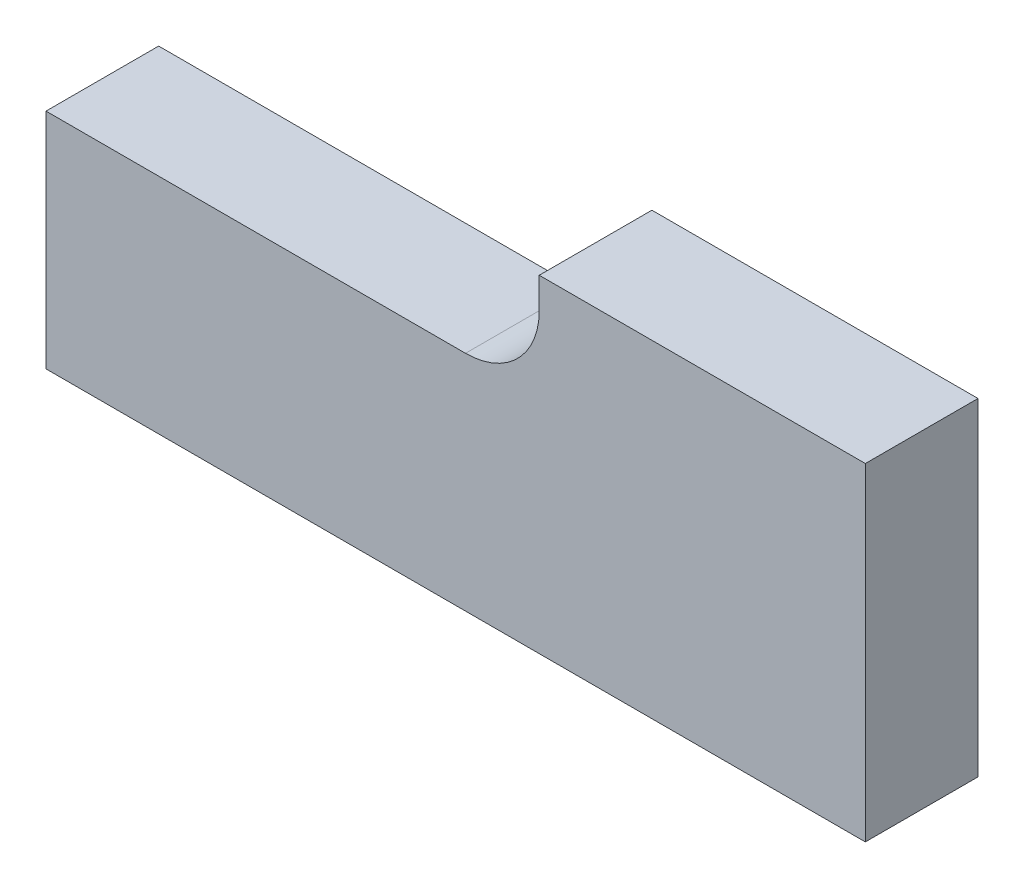
ISO-10303-21;
HEADER;
FILE_DESCRIPTION(('STEP AP214'),'2;1');
FILE_NAME('part.step','',(''),(''),'','','');
FILE_SCHEMA(('AUTOMOTIVE_DESIGN { 1 0 10303 214 1 1 1 1 }'));
ENDSEC;
DATA;
#1=APPLICATION_CONTEXT('core data for automotive mechanical design processes');
#2=APPLICATION_PROTOCOL_DEFINITION('international standard','automotive_design',2000,#1);
#3=PRODUCT_CONTEXT('',#1,'mechanical');
#4=PRODUCT('Part','Part','',(#3));
#5=PRODUCT_RELATED_PRODUCT_CATEGORY('part','',(#4));
#6=PRODUCT_DEFINITION_FORMATION('','',#4);
#7=PRODUCT_DEFINITION_CONTEXT('part definition',#1,'design');
#8=PRODUCT_DEFINITION('design','',#6,#7);
#9=PRODUCT_DEFINITION_SHAPE('','',#8);
#10=(LENGTH_UNIT() NAMED_UNIT(*) SI_UNIT(.MILLI.,.METRE.));
#11=(NAMED_UNIT(*) PLANE_ANGLE_UNIT() SI_UNIT($,.RADIAN.));
#12=(NAMED_UNIT(*) SI_UNIT($,.STERADIAN.) SOLID_ANGLE_UNIT());
#13=UNCERTAINTY_MEASURE_WITH_UNIT(LENGTH_MEASURE(1.E-05),#10,'distance_accuracy_value','');
#14=(GEOMETRIC_REPRESENTATION_CONTEXT(3) GLOBAL_UNCERTAINTY_ASSIGNED_CONTEXT((#13)) GLOBAL_UNIT_ASSIGNED_CONTEXT((#10,
#11,#12)) REPRESENTATION_CONTEXT('',''));
#15=CARTESIAN_POINT('',(0.,0.,0.));
#16=DIRECTION('',(0.,0.,1.));
#17=DIRECTION('',(1.,0.,0.));
#18=AXIS2_PLACEMENT_3D('',#15,#16,#17);
#19=CARTESIAN_POINT('',(127.,0.,17.4625));
#20=DIRECTION('',(0.,1.,0.));
#21=DIRECTION('',(-1.,0.,0.));
#22=AXIS2_PLACEMENT_3D('',#19,#20,#21);
#23=PLANE('',#22);
#24=DIRECTION('',(1.,0.,0.));
#25=VECTOR('',#24,1.);
#26=CARTESIAN_POINT('',(127.,0.,0.));
#27=LINE('',#26,#25);
#28=CARTESIAN_POINT('',(0.,0.,0.));
#29=VERTEX_POINT('',#28);
#30=CARTESIAN_POINT('',(127.,0.,0.));
#31=VERTEX_POINT('',#30);
#32=EDGE_CURVE('E123',#29,#31,#27,.T.);
#33=ORIENTED_EDGE('',*,*,#32,.T.);
#34=DIRECTION('',(0.,0.,-1.));
#35=VECTOR('',#34,1.);
#36=CARTESIAN_POINT('',(127.,0.,17.4625));
#37=LINE('',#36,#35);
#38=CARTESIAN_POINT('',(127.,0.,17.4625));
#39=VERTEX_POINT('',#38);
#40=EDGE_CURVE('E11',#39,#31,#37,.T.);
#41=ORIENTED_EDGE('',*,*,#40,.F.);
#42=DIRECTION('',(1.,0.,0.));
#43=VECTOR('',#42,1.);
#44=CARTESIAN_POINT('',(127.,0.,17.4625));
#45=LINE('',#44,#43);
#46=CARTESIAN_POINT('',(0.,0.,17.4625));
#47=VERTEX_POINT('',#46);
#48=EDGE_CURVE('E135',#47,#39,#45,.T.);
#49=ORIENTED_EDGE('',*,*,#48,.F.);
#50=DIRECTION('',(0.,0.,-1.));
#51=VECTOR('',#50,1.);
#52=CARTESIAN_POINT('',(0.,0.,17.4625));
#53=LINE('',#52,#51);
#54=EDGE_CURVE('E119',#47,#29,#53,.T.);
#55=ORIENTED_EDGE('',*,*,#54,.T.);
#56=EDGE_LOOP('',(#33,#41,#49,#55));
#57=FACE_BOUND('',#56,.T.);
#58=ADVANCED_FACE('F33',(#57),#23,.F.);
#59=CARTESIAN_POINT('',(127.,50.8,17.4625));
#60=DIRECTION('',(-1.,0.,0.));
#61=DIRECTION('',(0.,0.,1.));
#62=AXIS2_PLACEMENT_3D('',#59,#60,#61);
#63=PLANE('',#62);
#64=DIRECTION('',(0.,1.,0.));
#65=VECTOR('',#64,1.);
#66=CARTESIAN_POINT('',(127.,50.8,0.));
#67=LINE('',#66,#65);
#68=CARTESIAN_POINT('',(127.,50.8,0.));
#69=VERTEX_POINT('',#68);
#70=EDGE_CURVE('E126',#31,#69,#67,.T.);
#71=ORIENTED_EDGE('',*,*,#70,.T.);
#72=DIRECTION('',(0.,0.,-1.));
#73=VECTOR('',#72,1.);
#74=CARTESIAN_POINT('',(127.,50.8,17.4625));
#75=LINE('',#74,#73);
#76=CARTESIAN_POINT('',(127.,50.8,17.4625));
#77=VERTEX_POINT('',#76);
#78=EDGE_CURVE('E41',#77,#69,#75,.T.);
#79=ORIENTED_EDGE('',*,*,#78,.F.);
#80=DIRECTION('',(0.,1.,0.));
#81=VECTOR('',#80,1.);
#82=CARTESIAN_POINT('',(127.,50.8,17.4625));
#83=LINE('',#82,#81);
#84=EDGE_CURVE('E89',#39,#77,#83,.T.);
#85=ORIENTED_EDGE('',*,*,#84,.F.);
#86=ORIENTED_EDGE('',*,*,#40,.T.);
#87=EDGE_LOOP('',(#71,#79,#85,#86));
#88=FACE_BOUND('',#87,.T.);
#89=ADVANCED_FACE('F160',(#88),#63,.F.);
#90=CARTESIAN_POINT('',(76.454,50.8,17.4625));
#91=DIRECTION('',(0.,-1.,0.));
#92=DIRECTION('',(0.,0.,-1.));
#93=AXIS2_PLACEMENT_3D('',#90,#91,#92);
#94=PLANE('',#93);
#95=DIRECTION('',(-1.,0.,0.));
#96=VECTOR('',#95,1.);
#97=CARTESIAN_POINT('',(76.454,50.8,0.));
#98=LINE('',#97,#96);
#99=CARTESIAN_POINT('',(76.454,50.8,0.));
#100=VERTEX_POINT('',#99);
#101=EDGE_CURVE('E128',#69,#100,#98,.T.);
#102=ORIENTED_EDGE('',*,*,#101,.T.);
#103=DIRECTION('',(0.,0.,-1.));
#104=VECTOR('',#103,1.);
#105=CARTESIAN_POINT('',(76.454,50.8,17.4625));
#106=LINE('',#105,#104);
#107=CARTESIAN_POINT('',(76.454,50.8,17.4625));
#108=VERTEX_POINT('',#107);
#109=EDGE_CURVE('E139',#108,#100,#106,.T.);
#110=ORIENTED_EDGE('',*,*,#109,.F.);
#111=DIRECTION('',(-1.,0.,0.));
#112=VECTOR('',#111,1.);
#113=CARTESIAN_POINT('',(76.454,50.8,17.4625));
#114=LINE('',#113,#112);
#115=EDGE_CURVE('E147',#77,#108,#114,.T.);
#116=ORIENTED_EDGE('',*,*,#115,.F.);
#117=ORIENTED_EDGE('',*,*,#78,.T.);
#118=EDGE_LOOP('',(#102,#110,#116,#117));
#119=FACE_BOUND('',#118,.T.);
#120=ADVANCED_FACE('F145',(#119),#94,.F.);
#121=CARTESIAN_POINT('',(76.454,46.0375,17.4625));
#122=DIRECTION('',(1.,0.,0.));
#123=DIRECTION('',(0.,0.,-1.));
#124=AXIS2_PLACEMENT_3D('',#121,#122,#123);
#125=PLANE('',#124);
#126=DIRECTION('',(0.,-1.,0.));
#127=VECTOR('',#126,1.);
#128=CARTESIAN_POINT('',(76.454,46.0375,0.));
#129=LINE('',#128,#127);
#130=CARTESIAN_POINT('',(76.454,46.0375,0.));
#131=VERTEX_POINT('',#130);
#132=EDGE_CURVE('E130',#100,#131,#129,.T.);
#133=ORIENTED_EDGE('',*,*,#132,.T.);
#134=DIRECTION('',(0.,0.,-1.));
#135=VECTOR('',#134,1.);
#136=CARTESIAN_POINT('',(76.454,46.0375,17.4625));
#137=LINE('',#136,#135);
#138=CARTESIAN_POINT('',(76.454,46.0375,17.4625));
#139=VERTEX_POINT('',#138);
#140=EDGE_CURVE('E114',#139,#131,#137,.T.);
#141=ORIENTED_EDGE('',*,*,#140,.F.);
#142=DIRECTION('',(0.,-1.,0.));
#143=VECTOR('',#142,1.);
#144=CARTESIAN_POINT('',(76.454,46.0375,17.4625));
#145=LINE('',#144,#143);
#146=EDGE_CURVE('E105',#108,#139,#145,.T.);
#147=ORIENTED_EDGE('',*,*,#146,.F.);
#148=ORIENTED_EDGE('',*,*,#109,.T.);
#149=EDGE_LOOP('',(#133,#141,#147,#148));
#150=FACE_BOUND('',#149,.T.);
#151=ADVANCED_FACE('F153',(#150),#125,.F.);
#152=CARTESIAN_POINT('',(65.024,46.0375,17.4625));
#153=DIRECTION('',(0.,0.,-1.));
#154=DIRECTION('',(-1.,0.,0.));
#155=AXIS2_PLACEMENT_3D('',#152,#153,#154);
#156=CYLINDRICAL_SURFACE('',#155,11.43);
#157=CARTESIAN_POINT('',(65.024,46.0375,0.));
#158=DIRECTION('',(0.,0.,-1.));
#159=DIRECTION('',(1.,0.,0.));
#160=AXIS2_PLACEMENT_3D('',#157,#158,#159);
#161=CIRCLE('',#160,11.43);
#162=CARTESIAN_POINT('',(65.024,34.6075,0.));
#163=VERTEX_POINT('',#162);
#164=EDGE_CURVE('E113',#131,#163,#161,.T.);
#165=ORIENTED_EDGE('',*,*,#164,.T.);
#166=DIRECTION('',(0.,0.,-1.));
#167=VECTOR('',#166,1.);
#168=CARTESIAN_POINT('',(65.024,34.6075,17.4625));
#169=LINE('',#168,#167);
#170=CARTESIAN_POINT('',(65.024,34.6075,17.4625));
#171=VERTEX_POINT('',#170);
#172=EDGE_CURVE('E110',#171,#163,#169,.T.);
#173=ORIENTED_EDGE('',*,*,#172,.F.);
#174=CARTESIAN_POINT('',(65.024,46.0375,17.4625));
#175=DIRECTION('',(0.,0.,-1.));
#176=DIRECTION('',(1.,0.,0.));
#177=AXIS2_PLACEMENT_3D('',#174,#175,#176);
#178=CIRCLE('',#177,11.43);
#179=EDGE_CURVE('E99',#139,#171,#178,.T.);
#180=ORIENTED_EDGE('',*,*,#179,.F.);
#181=ORIENTED_EDGE('',*,*,#140,.T.);
#182=EDGE_LOOP('',(#165,#173,#180,#181));
#183=FACE_BOUND('',#182,.T.);
#184=ADVANCED_FACE('F111',(#183),#156,.F.);
#185=CARTESIAN_POINT('',(0.,34.6075,17.4625));
#186=DIRECTION('',(0.,-1.,0.));
#187=DIRECTION('',(0.,0.,-1.));
#188=AXIS2_PLACEMENT_3D('',#185,#186,#187);
#189=PLANE('',#188);
#190=DIRECTION('',(-1.,0.,0.));
#191=VECTOR('',#190,1.);
#192=CARTESIAN_POINT('',(0.,34.6075,0.));
#193=LINE('',#192,#191);
#194=CARTESIAN_POINT('',(0.,34.6075,0.));
#195=VERTEX_POINT('',#194);
#196=EDGE_CURVE('E75',#163,#195,#193,.T.);
#197=ORIENTED_EDGE('',*,*,#196,.T.);
#198=DIRECTION('',(0.,0.,-1.));
#199=VECTOR('',#198,1.);
#200=CARTESIAN_POINT('',(0.,34.6075,17.4625));
#201=LINE('',#200,#199);
#202=CARTESIAN_POINT('',(0.,34.6075,17.4625));
#203=VERTEX_POINT('',#202);
#204=EDGE_CURVE('E115',#203,#195,#201,.T.);
#205=ORIENTED_EDGE('',*,*,#204,.F.);
#206=DIRECTION('',(-1.,0.,0.));
#207=VECTOR('',#206,1.);
#208=CARTESIAN_POINT('',(0.,34.6075,17.4625));
#209=LINE('',#208,#207);
#210=EDGE_CURVE('E103',#171,#203,#209,.T.);
#211=ORIENTED_EDGE('',*,*,#210,.F.);
#212=ORIENTED_EDGE('',*,*,#172,.T.);
#213=EDGE_LOOP('',(#197,#205,#211,#212));
#214=FACE_BOUND('',#213,.T.);
#215=ADVANCED_FACE('F117',(#214),#189,.F.);
#216=CARTESIAN_POINT('',(0.,0.,17.4625));
#217=DIRECTION('',(1.,0.,0.));
#218=DIRECTION('',(0.,0.,-1.));
#219=AXIS2_PLACEMENT_3D('',#216,#217,#218);
#220=PLANE('',#219);
#221=DIRECTION('',(0.,-1.,0.));
#222=VECTOR('',#221,1.);
#223=CARTESIAN_POINT('',(0.,0.,0.));
#224=LINE('',#223,#222);
#225=EDGE_CURVE('E81',#195,#29,#224,.T.);
#226=ORIENTED_EDGE('',*,*,#225,.T.);
#227=ORIENTED_EDGE('',*,*,#54,.F.);
#228=DIRECTION('',(0.,-1.,0.));
#229=VECTOR('',#228,1.);
#230=CARTESIAN_POINT('',(0.,0.,17.4625));
#231=LINE('',#230,#229);
#232=EDGE_CURVE('E49',#203,#47,#231,.T.);
#233=ORIENTED_EDGE('',*,*,#232,.F.);
#234=ORIENTED_EDGE('',*,*,#204,.T.);
#235=EDGE_LOOP('',(#226,#227,#233,#234));
#236=FACE_BOUND('',#235,.T.);
#237=ADVANCED_FACE('F174',(#236),#220,.F.);
#238=CARTESIAN_POINT('',(65.024,46.0375,17.4625));
#239=DIRECTION('',(0.,0.,1.));
#240=DIRECTION('',(1.,0.,0.));
#241=AXIS2_PLACEMENT_3D('',#238,#239,#240);
#242=PLANE('',#241);
#243=ORIENTED_EDGE('',*,*,#48,.T.);
#244=ORIENTED_EDGE('',*,*,#84,.T.);
#245=ORIENTED_EDGE('',*,*,#115,.T.);
#246=ORIENTED_EDGE('',*,*,#146,.T.);
#247=ORIENTED_EDGE('',*,*,#179,.T.);
#248=ORIENTED_EDGE('',*,*,#210,.T.);
#249=ORIENTED_EDGE('',*,*,#232,.T.);
#250=EDGE_LOOP('',(#243,#244,#245,#246,#247,#248,#249));
#251=FACE_BOUND('',#250,.T.);
#252=ADVANCED_FACE('F101',(#251),#242,.T.);
#253=CARTESIAN_POINT('',(65.024,46.0375,0.));
#254=DIRECTION('',(0.,0.,1.));
#255=DIRECTION('',(1.,0.,0.));
#256=AXIS2_PLACEMENT_3D('',#253,#254,#255);
#257=PLANE('',#256);
#258=ORIENTED_EDGE('',*,*,#32,.F.);
#259=ORIENTED_EDGE('',*,*,#225,.F.);
#260=ORIENTED_EDGE('',*,*,#196,.F.);
#261=ORIENTED_EDGE('',*,*,#164,.F.);
#262=ORIENTED_EDGE('',*,*,#132,.F.);
#263=ORIENTED_EDGE('',*,*,#101,.F.);
#264=ORIENTED_EDGE('',*,*,#70,.F.);
#265=EDGE_LOOP('',(#258,#259,#260,#261,#262,#263,#264));
#266=FACE_BOUND('',#265,.T.);
#267=ADVANCED_FACE('F151',(#266),#257,.F.);
#268=CLOSED_SHELL('',(#58,#89,#120,#151,#184,#215,#237,#252,#267));
#269=MANIFOLD_SOLID_BREP('B2',#268);
#270=ADVANCED_BREP_SHAPE_REPRESENTATION('',(#18,#269),#14);
#271=SHAPE_DEFINITION_REPRESENTATION(#9,#270);
ENDSEC;
END-ISO-10303-21;
